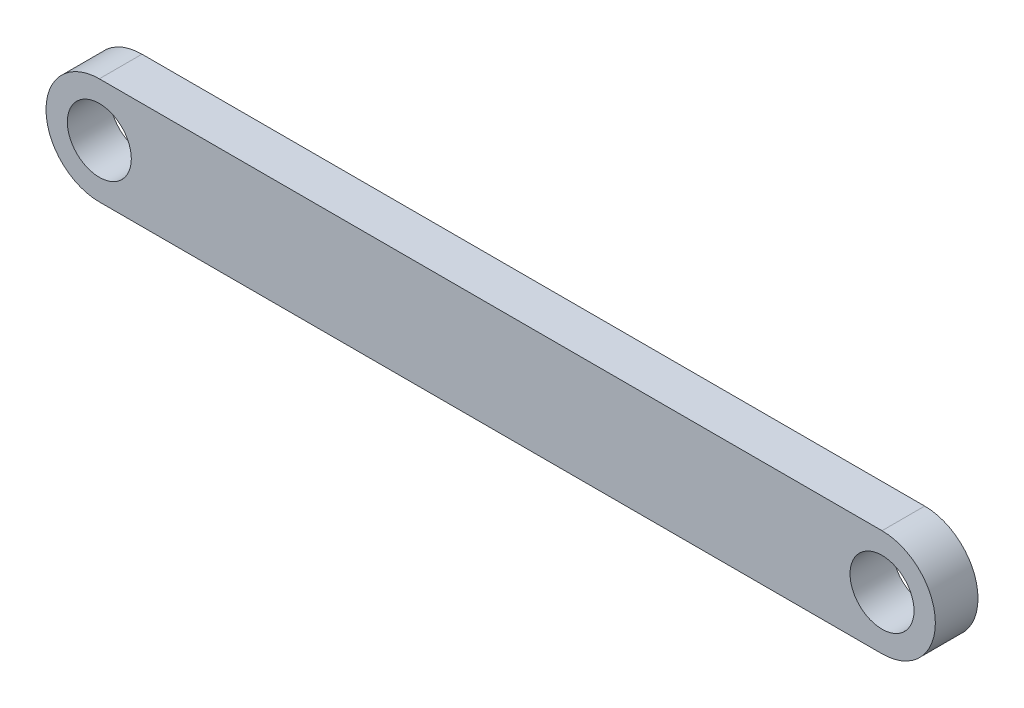
ISO-10303-21;
HEADER;
FILE_DESCRIPTION(('STEP AP214'),'2;1');
FILE_NAME('part.step','',(''),(''),'','','');
FILE_SCHEMA(('AUTOMOTIVE_DESIGN { 1 0 10303 214 1 1 1 1 }'));
ENDSEC;
DATA;
#1=APPLICATION_CONTEXT('core data for automotive mechanical design processes');
#2=APPLICATION_PROTOCOL_DEFINITION('international standard','automotive_design',2000,#1);
#3=PRODUCT_CONTEXT('',#1,'mechanical');
#4=PRODUCT('Part','Part','',(#3));
#5=PRODUCT_RELATED_PRODUCT_CATEGORY('part','',(#4));
#6=PRODUCT_DEFINITION_FORMATION('','',#4);
#7=PRODUCT_DEFINITION_CONTEXT('part definition',#1,'design');
#8=PRODUCT_DEFINITION('design','',#6,#7);
#9=PRODUCT_DEFINITION_SHAPE('','',#8);
#10=(LENGTH_UNIT() NAMED_UNIT(*) SI_UNIT(.MILLI.,.METRE.));
#11=(NAMED_UNIT(*) PLANE_ANGLE_UNIT() SI_UNIT($,.RADIAN.));
#12=(NAMED_UNIT(*) SI_UNIT($,.STERADIAN.) SOLID_ANGLE_UNIT());
#13=UNCERTAINTY_MEASURE_WITH_UNIT(LENGTH_MEASURE(1.E-05),#10,'distance_accuracy_value','');
#14=(GEOMETRIC_REPRESENTATION_CONTEXT(3) GLOBAL_UNCERTAINTY_ASSIGNED_CONTEXT((#13)) GLOBAL_UNIT_ASSIGNED_CONTEXT((#10,
#11,#12)) REPRESENTATION_CONTEXT('',''));
#15=CARTESIAN_POINT('',(0.,0.,0.));
#16=DIRECTION('',(0.,0.,1.));
#17=DIRECTION('',(1.,0.,0.));
#18=AXIS2_PLACEMENT_3D('',#15,#16,#17);
#19=CARTESIAN_POINT('',(0.148728395832749,0.0295227428593007,2.));
#20=DIRECTION('',(0.,0.,1.));
#21=DIRECTION('',(1.,0.,0.));
#22=AXIS2_PLACEMENT_3D('',#19,#20,#21);
#23=PLANE('',#22);
#24=CARTESIAN_POINT('',(0.148728395832749,0.0295227428593007,2.));
#25=DIRECTION('',(0.,0.,1.));
#26=DIRECTION('',(1.,0.,0.));
#27=AXIS2_PLACEMENT_3D('',#24,#25,#26);
#28=CIRCLE('',#27,1.5);
#29=CARTESIAN_POINT('',(1.64872839583275,0.0295227428593007,2.));
#30=VERTEX_POINT('',#29);
#31=EDGE_CURVE('E128',#30,#30,#28,.T.);
#32=ORIENTED_EDGE('',*,*,#31,.F.);
#33=EDGE_LOOP('',(#32));
#34=FACE_BOUND('',#33,.T.);
#35=CARTESIAN_POINT('',(0.148728395832749,0.0295227428593007,2.));
#36=DIRECTION('',(0.,0.,1.));
#37=DIRECTION('',(1.,0.,0.));
#38=AXIS2_PLACEMENT_3D('',#35,#36,#37);
#39=CIRCLE('',#38,2.5);
#40=CARTESIAN_POINT('',(0.148728395832749,2.5295227428593,2.));
#41=VERTEX_POINT('',#40);
#42=CARTESIAN_POINT('',(0.148728395832749,-2.4704772571407,2.));
#43=VERTEX_POINT('',#42);
#44=EDGE_CURVE('E112',#41,#43,#39,.T.);
#45=ORIENTED_EDGE('',*,*,#44,.T.);
#46=DIRECTION('',(1.,0.,0.));
#47=VECTOR('',#46,1.);
#48=CARTESIAN_POINT('',(0.148728395832749,-2.4704772571407,2.));
#49=LINE('',#48,#47);
#50=CARTESIAN_POINT('',(36.8487283958328,-2.4704772571407,2.));
#51=VERTEX_POINT('',#50);
#52=EDGE_CURVE('E105',#43,#51,#49,.T.);
#53=ORIENTED_EDGE('',*,*,#52,.T.);
#54=CARTESIAN_POINT('',(36.8487283958328,0.0295227428593007,2.));
#55=DIRECTION('',(0.,0.,1.));
#56=DIRECTION('',(1.,0.,0.));
#57=AXIS2_PLACEMENT_3D('',#54,#55,#56);
#58=CIRCLE('',#57,2.5);
#59=CARTESIAN_POINT('',(36.8487283958328,2.5295227428593,2.));
#60=VERTEX_POINT('',#59);
#61=EDGE_CURVE('E111',#51,#60,#58,.T.);
#62=ORIENTED_EDGE('',*,*,#61,.T.);
#63=DIRECTION('',(1.,0.,0.));
#64=VECTOR('',#63,1.);
#65=CARTESIAN_POINT('',(0.148728395832749,2.5295227428593,2.));
#66=LINE('',#65,#64);
#67=EDGE_CURVE('E121',#41,#60,#66,.T.);
#68=ORIENTED_EDGE('',*,*,#67,.F.);
#69=EDGE_LOOP('',(#45,#53,#62,#68));
#70=FACE_BOUND('',#69,.T.);
#71=CARTESIAN_POINT('',(36.8487283958328,0.0295227428593007,2.));
#72=DIRECTION('',(0.,0.,1.));
#73=DIRECTION('',(1.,0.,0.));
#74=AXIS2_PLACEMENT_3D('',#71,#72,#73);
#75=CIRCLE('',#74,1.5);
#76=CARTESIAN_POINT('',(38.3487283958328,0.0295227428593007,2.));
#77=VERTEX_POINT('',#76);
#78=EDGE_CURVE('E141',#77,#77,#75,.T.);
#79=ORIENTED_EDGE('',*,*,#78,.F.);
#80=EDGE_LOOP('',(#79));
#81=FACE_BOUND('',#80,.T.);
#82=ADVANCED_FACE('F62',(#34,#70,#81),#23,.T.);
#83=CARTESIAN_POINT('',(0.148728395832749,0.0295227428593007,0.));
#84=DIRECTION('',(0.,0.,1.));
#85=DIRECTION('',(1.,0.,0.));
#86=AXIS2_PLACEMENT_3D('',#83,#84,#85);
#87=PLANE('',#86);
#88=CARTESIAN_POINT('',(0.148728395832749,0.0295227428593007,0.));
#89=DIRECTION('',(0.,0.,1.));
#90=DIRECTION('',(1.,0.,0.));
#91=AXIS2_PLACEMENT_3D('',#88,#89,#90);
#92=CIRCLE('',#91,2.5);
#93=CARTESIAN_POINT('',(0.148728395832749,2.5295227428593,0.));
#94=VERTEX_POINT('',#93);
#95=CARTESIAN_POINT('',(0.148728395832749,-2.4704772571407,0.));
#96=VERTEX_POINT('',#95);
#97=EDGE_CURVE('E126',#94,#96,#92,.T.);
#98=ORIENTED_EDGE('',*,*,#97,.F.);
#99=DIRECTION('',(1.,0.,0.));
#100=VECTOR('',#99,1.);
#101=CARTESIAN_POINT('',(0.148728395832749,2.5295227428593,0.));
#102=LINE('',#101,#100);
#103=CARTESIAN_POINT('',(36.8487283958328,2.5295227428593,0.));
#104=VERTEX_POINT('',#103);
#105=EDGE_CURVE('E132',#94,#104,#102,.T.);
#106=ORIENTED_EDGE('',*,*,#105,.T.);
#107=CARTESIAN_POINT('',(36.8487283958328,0.0295227428593007,0.));
#108=DIRECTION('',(0.,0.,1.));
#109=DIRECTION('',(1.,0.,0.));
#110=AXIS2_PLACEMENT_3D('',#107,#108,#109);
#111=CIRCLE('',#110,2.5);
#112=CARTESIAN_POINT('',(36.8487283958328,-2.4704772571407,0.));
#113=VERTEX_POINT('',#112);
#114=EDGE_CURVE('E130',#113,#104,#111,.T.);
#115=ORIENTED_EDGE('',*,*,#114,.F.);
#116=DIRECTION('',(1.,0.,0.));
#117=VECTOR('',#116,1.);
#118=CARTESIAN_POINT('',(0.148728395832749,-2.4704772571407,0.));
#119=LINE('',#118,#117);
#120=EDGE_CURVE('E117',#96,#113,#119,.T.);
#121=ORIENTED_EDGE('',*,*,#120,.F.);
#122=EDGE_LOOP('',(#98,#106,#115,#121));
#123=FACE_BOUND('',#122,.T.);
#124=CARTESIAN_POINT('',(0.148728395832749,0.0295227428593007,0.));
#125=DIRECTION('',(0.,0.,1.));
#126=DIRECTION('',(1.,0.,0.));
#127=AXIS2_PLACEMENT_3D('',#124,#125,#126);
#128=CIRCLE('',#127,1.5);
#129=CARTESIAN_POINT('',(1.64872839583275,0.0295227428593007,0.));
#130=VERTEX_POINT('',#129);
#131=EDGE_CURVE('E138',#130,#130,#128,.T.);
#132=ORIENTED_EDGE('',*,*,#131,.T.);
#133=EDGE_LOOP('',(#132));
#134=FACE_BOUND('',#133,.T.);
#135=CARTESIAN_POINT('',(36.8487283958328,0.0295227428593007,0.));
#136=DIRECTION('',(0.,0.,1.));
#137=DIRECTION('',(1.,0.,0.));
#138=AXIS2_PLACEMENT_3D('',#135,#136,#137);
#139=CIRCLE('',#138,1.5);
#140=CARTESIAN_POINT('',(38.3487283958328,0.0295227428593007,0.));
#141=VERTEX_POINT('',#140);
#142=EDGE_CURVE('E144',#141,#141,#139,.T.);
#143=ORIENTED_EDGE('',*,*,#142,.T.);
#144=EDGE_LOOP('',(#143));
#145=FACE_BOUND('',#144,.T.);
#146=ADVANCED_FACE('F153',(#123,#134,#145),#87,.F.);
#147=CARTESIAN_POINT('',(0.148728395832749,0.0295227428593007,2.));
#148=DIRECTION('',(0.,0.,-1.));
#149=DIRECTION('',(-1.,0.,0.));
#150=AXIS2_PLACEMENT_3D('',#147,#148,#149);
#151=CYLINDRICAL_SURFACE('',#150,2.5);
#152=ORIENTED_EDGE('',*,*,#97,.T.);
#153=DIRECTION('',(0.,0.,-1.));
#154=VECTOR('',#153,1.);
#155=CARTESIAN_POINT('',(0.148728395832749,-2.4704772571407,2.));
#156=LINE('',#155,#154);
#157=EDGE_CURVE('E12',#43,#96,#156,.T.);
#158=ORIENTED_EDGE('',*,*,#157,.F.);
#159=ORIENTED_EDGE('',*,*,#44,.F.);
#160=DIRECTION('',(0.,0.,-1.));
#161=VECTOR('',#160,1.);
#162=CARTESIAN_POINT('',(0.148728395832749,2.5295227428593,2.));
#163=LINE('',#162,#161);
#164=EDGE_CURVE('E79',#41,#94,#163,.T.);
#165=ORIENTED_EDGE('',*,*,#164,.T.);
#166=EDGE_LOOP('',(#152,#158,#159,#165));
#167=FACE_BOUND('',#166,.T.);
#168=ADVANCED_FACE('F64',(#167),#151,.T.);
#169=CARTESIAN_POINT('',(0.148728395832749,-2.4704772571407,2.));
#170=DIRECTION('',(0.,1.,0.));
#171=DIRECTION('',(0.,0.,1.));
#172=AXIS2_PLACEMENT_3D('',#169,#170,#171);
#173=PLANE('',#172);
#174=ORIENTED_EDGE('',*,*,#120,.T.);
#175=DIRECTION('',(0.,0.,-1.));
#176=VECTOR('',#175,1.);
#177=CARTESIAN_POINT('',(36.8487283958328,-2.4704772571407,2.));
#178=LINE('',#177,#176);
#179=EDGE_CURVE('E71',#51,#113,#178,.T.);
#180=ORIENTED_EDGE('',*,*,#179,.F.);
#181=ORIENTED_EDGE('',*,*,#52,.F.);
#182=ORIENTED_EDGE('',*,*,#157,.T.);
#183=EDGE_LOOP('',(#174,#180,#181,#182));
#184=FACE_BOUND('',#183,.T.);
#185=ADVANCED_FACE('F116',(#184),#173,.F.);
#186=CARTESIAN_POINT('',(36.8487283958328,0.0295227428593007,2.));
#187=DIRECTION('',(0.,0.,-1.));
#188=DIRECTION('',(-1.,0.,0.));
#189=AXIS2_PLACEMENT_3D('',#186,#187,#188);
#190=CYLINDRICAL_SURFACE('',#189,2.5);
#191=ORIENTED_EDGE('',*,*,#114,.T.);
#192=DIRECTION('',(0.,0.,-1.));
#193=VECTOR('',#192,1.);
#194=CARTESIAN_POINT('',(36.8487283958328,2.5295227428593,2.));
#195=LINE('',#194,#193);
#196=EDGE_CURVE('E94',#60,#104,#195,.T.);
#197=ORIENTED_EDGE('',*,*,#196,.F.);
#198=ORIENTED_EDGE('',*,*,#61,.F.);
#199=ORIENTED_EDGE('',*,*,#179,.T.);
#200=EDGE_LOOP('',(#191,#197,#198,#199));
#201=FACE_BOUND('',#200,.T.);
#202=ADVANCED_FACE('F120',(#201),#190,.T.);
#203=CARTESIAN_POINT('',(0.148728395832749,2.5295227428593,2.));
#204=DIRECTION('',(0.,1.,0.));
#205=DIRECTION('',(0.,0.,1.));
#206=AXIS2_PLACEMENT_3D('',#203,#204,#205);
#207=PLANE('',#206);
#208=ORIENTED_EDGE('',*,*,#105,.F.);
#209=ORIENTED_EDGE('',*,*,#164,.F.);
#210=ORIENTED_EDGE('',*,*,#67,.T.);
#211=ORIENTED_EDGE('',*,*,#196,.T.);
#212=EDGE_LOOP('',(#208,#209,#210,#211));
#213=FACE_BOUND('',#212,.T.);
#214=ADVANCED_FACE('F165',(#213),#207,.T.);
#215=CARTESIAN_POINT('',(0.148728395832749,0.0295227428593007,2.));
#216=DIRECTION('',(0.,0.,-1.));
#217=DIRECTION('',(-1.,0.,0.));
#218=AXIS2_PLACEMENT_3D('',#215,#216,#217);
#219=CYLINDRICAL_SURFACE('',#218,1.5);
#220=ORIENTED_EDGE('',*,*,#31,.T.);
#221=EDGE_LOOP('',(#220));
#222=FACE_BOUND('',#221,.T.);
#223=ORIENTED_EDGE('',*,*,#131,.F.);
#224=EDGE_LOOP('',(#223));
#225=FACE_BOUND('',#224,.T.);
#226=ADVANCED_FACE('F162',(#222,#225),#219,.F.);
#227=CARTESIAN_POINT('',(36.8487283958328,0.0295227428593007,2.));
#228=DIRECTION('',(0.,0.,-1.));
#229=DIRECTION('',(-1.,0.,0.));
#230=AXIS2_PLACEMENT_3D('',#227,#228,#229);
#231=CYLINDRICAL_SURFACE('',#230,1.5);
#232=ORIENTED_EDGE('',*,*,#78,.T.);
#233=EDGE_LOOP('',(#232));
#234=FACE_BOUND('',#233,.T.);
#235=ORIENTED_EDGE('',*,*,#142,.F.);
#236=EDGE_LOOP('',(#235));
#237=FACE_BOUND('',#236,.T.);
#238=ADVANCED_FACE('F150',(#234,#237),#231,.F.);
#239=CLOSED_SHELL('',(#82,#146,#168,#185,#202,#214,#226,#238));
#240=MANIFOLD_SOLID_BREP('B2',#239);
#241=ADVANCED_BREP_SHAPE_REPRESENTATION('',(#18,#240),#14);
#242=SHAPE_DEFINITION_REPRESENTATION(#9,#241);
ENDSEC;
END-ISO-10303-21;
